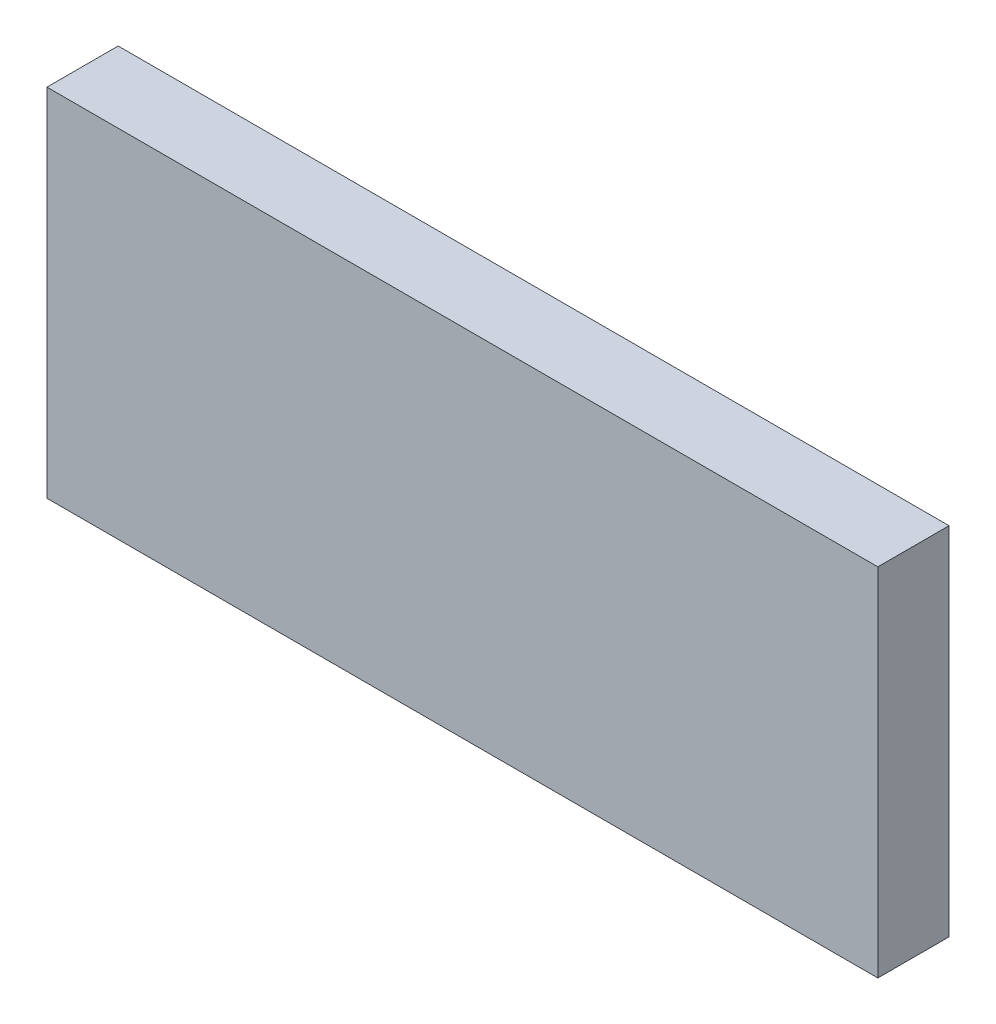
ISO-10303-21;
HEADER;
FILE_DESCRIPTION(('STEP AP214'),'2;1');
FILE_NAME('part.step','',(''),(''),'','','');
FILE_SCHEMA(('AUTOMOTIVE_DESIGN { 1 0 10303 214 1 1 1 1 }'));
ENDSEC;
DATA;
#1=APPLICATION_CONTEXT('core data for automotive mechanical design processes');
#2=APPLICATION_PROTOCOL_DEFINITION('international standard','automotive_design',2000,#1);
#3=PRODUCT_CONTEXT('',#1,'mechanical');
#4=PRODUCT('Part','Part','',(#3));
#5=PRODUCT_RELATED_PRODUCT_CATEGORY('part','',(#4));
#6=PRODUCT_DEFINITION_FORMATION('','',#4);
#7=PRODUCT_DEFINITION_CONTEXT('part definition',#1,'design');
#8=PRODUCT_DEFINITION('design','',#6,#7);
#9=PRODUCT_DEFINITION_SHAPE('','',#8);
#10=(LENGTH_UNIT() NAMED_UNIT(*) SI_UNIT(.MILLI.,.METRE.));
#11=(NAMED_UNIT(*) PLANE_ANGLE_UNIT() SI_UNIT($,.RADIAN.));
#12=(NAMED_UNIT(*) SI_UNIT($,.STERADIAN.) SOLID_ANGLE_UNIT());
#13=UNCERTAINTY_MEASURE_WITH_UNIT(LENGTH_MEASURE(1.E-05),#10,'distance_accuracy_value','');
#14=(GEOMETRIC_REPRESENTATION_CONTEXT(3) GLOBAL_UNCERTAINTY_ASSIGNED_CONTEXT((#13)) GLOBAL_UNIT_ASSIGNED_CONTEXT((#10,
#11,#12)) REPRESENTATION_CONTEXT('',''));
#15=CARTESIAN_POINT('',(0.,0.,0.));
#16=DIRECTION('',(0.,0.,1.));
#17=DIRECTION('',(1.,0.,0.));
#18=AXIS2_PLACEMENT_3D('',#15,#16,#17);
#19=CARTESIAN_POINT('',(17.5,-7.5,3.));
#20=DIRECTION('',(-1.,0.,0.));
#21=DIRECTION('',(0.,0.,1.));
#22=AXIS2_PLACEMENT_3D('',#19,#20,#21);
#23=PLANE('',#22);
#24=DIRECTION('',(0.,1.,0.));
#25=VECTOR('',#24,1.);
#26=CARTESIAN_POINT('',(17.5,-7.5,0.));
#27=LINE('',#26,#25);
#28=CARTESIAN_POINT('',(17.5,-7.5,0.));
#29=VERTEX_POINT('',#28);
#30=CARTESIAN_POINT('',(17.5,7.5,0.));
#31=VERTEX_POINT('',#30);
#32=EDGE_CURVE('E111',#29,#31,#27,.T.);
#33=ORIENTED_EDGE('',*,*,#32,.T.);
#34=DIRECTION('',(0.,0.,-1.));
#35=VECTOR('',#34,1.);
#36=CARTESIAN_POINT('',(17.5,7.5,3.));
#37=LINE('',#36,#35);
#38=CARTESIAN_POINT('',(17.5,7.5,3.));
#39=VERTEX_POINT('',#38);
#40=EDGE_CURVE('E11',#39,#31,#37,.T.);
#41=ORIENTED_EDGE('',*,*,#40,.F.);
#42=DIRECTION('',(0.,1.,0.));
#43=VECTOR('',#42,1.);
#44=CARTESIAN_POINT('',(17.5,-7.5,3.));
#45=LINE('',#44,#43);
#46=CARTESIAN_POINT('',(17.5,-7.5,3.));
#47=VERTEX_POINT('',#46);
#48=EDGE_CURVE('E95',#47,#39,#45,.T.);
#49=ORIENTED_EDGE('',*,*,#48,.F.);
#50=DIRECTION('',(0.,0.,-1.));
#51=VECTOR('',#50,1.);
#52=CARTESIAN_POINT('',(17.5,-7.5,3.));
#53=LINE('',#52,#51);
#54=EDGE_CURVE('E107',#47,#29,#53,.T.);
#55=ORIENTED_EDGE('',*,*,#54,.T.);
#56=EDGE_LOOP('',(#33,#41,#49,#55));
#57=FACE_BOUND('',#56,.T.);
#58=ADVANCED_FACE('F43',(#57),#23,.F.);
#59=CARTESIAN_POINT('',(-17.5,7.5,3.));
#60=DIRECTION('',(0.,-1.,0.));
#61=DIRECTION('',(0.,0.,-1.));
#62=AXIS2_PLACEMENT_3D('',#59,#60,#61);
#63=PLANE('',#62);
#64=DIRECTION('',(-1.,0.,0.));
#65=VECTOR('',#64,1.);
#66=CARTESIAN_POINT('',(-17.5,7.5,0.));
#67=LINE('',#66,#65);
#68=CARTESIAN_POINT('',(-17.5,7.5,0.));
#69=VERTEX_POINT('',#68);
#70=EDGE_CURVE('E100',#31,#69,#67,.T.);
#71=ORIENTED_EDGE('',*,*,#70,.T.);
#72=DIRECTION('',(0.,0.,-1.));
#73=VECTOR('',#72,1.);
#74=CARTESIAN_POINT('',(-17.5,7.5,3.));
#75=LINE('',#74,#73);
#76=CARTESIAN_POINT('',(-17.5,7.5,3.));
#77=VERTEX_POINT('',#76);
#78=EDGE_CURVE('E52',#77,#69,#75,.T.);
#79=ORIENTED_EDGE('',*,*,#78,.F.);
#80=DIRECTION('',(-1.,0.,0.));
#81=VECTOR('',#80,1.);
#82=CARTESIAN_POINT('',(-17.5,7.5,3.));
#83=LINE('',#82,#81);
#84=EDGE_CURVE('E90',#39,#77,#83,.T.);
#85=ORIENTED_EDGE('',*,*,#84,.F.);
#86=ORIENTED_EDGE('',*,*,#40,.T.);
#87=EDGE_LOOP('',(#71,#79,#85,#86));
#88=FACE_BOUND('',#87,.T.);
#89=ADVANCED_FACE('F99',(#88),#63,.F.);
#90=CARTESIAN_POINT('',(-17.5,-7.5,3.));
#91=DIRECTION('',(1.,0.,0.));
#92=DIRECTION('',(0.,0.,-1.));
#93=AXIS2_PLACEMENT_3D('',#90,#91,#92);
#94=PLANE('',#93);
#95=DIRECTION('',(0.,-1.,0.));
#96=VECTOR('',#95,1.);
#97=CARTESIAN_POINT('',(-17.5,-7.5,0.));
#98=LINE('',#97,#96);
#99=CARTESIAN_POINT('',(-17.5,-7.5,0.));
#100=VERTEX_POINT('',#99);
#101=EDGE_CURVE('E77',#69,#100,#98,.T.);
#102=ORIENTED_EDGE('',*,*,#101,.T.);
#103=DIRECTION('',(0.,0.,-1.));
#104=VECTOR('',#103,1.);
#105=CARTESIAN_POINT('',(-17.5,-7.5,3.));
#106=LINE('',#105,#104);
#107=CARTESIAN_POINT('',(-17.5,-7.5,3.));
#108=VERTEX_POINT('',#107);
#109=EDGE_CURVE('E102',#108,#100,#106,.T.);
#110=ORIENTED_EDGE('',*,*,#109,.F.);
#111=DIRECTION('',(0.,-1.,0.));
#112=VECTOR('',#111,1.);
#113=CARTESIAN_POINT('',(-17.5,-7.5,3.));
#114=LINE('',#113,#112);
#115=EDGE_CURVE('E93',#77,#108,#114,.T.);
#116=ORIENTED_EDGE('',*,*,#115,.F.);
#117=ORIENTED_EDGE('',*,*,#78,.T.);
#118=EDGE_LOOP('',(#102,#110,#116,#117));
#119=FACE_BOUND('',#118,.T.);
#120=ADVANCED_FACE('F103',(#119),#94,.F.);
#121=CARTESIAN_POINT('',(-17.5,-7.5,3.));
#122=DIRECTION('',(0.,1.,0.));
#123=DIRECTION('',(0.,0.,1.));
#124=AXIS2_PLACEMENT_3D('',#121,#122,#123);
#125=PLANE('',#124);
#126=DIRECTION('',(1.,0.,0.));
#127=VECTOR('',#126,1.);
#128=CARTESIAN_POINT('',(-17.5,-7.5,0.));
#129=LINE('',#128,#127);
#130=EDGE_CURVE('E83',#100,#29,#129,.T.);
#131=ORIENTED_EDGE('',*,*,#130,.T.);
#132=ORIENTED_EDGE('',*,*,#54,.F.);
#133=DIRECTION('',(1.,0.,0.));
#134=VECTOR('',#133,1.);
#135=CARTESIAN_POINT('',(-17.5,-7.5,3.));
#136=LINE('',#135,#134);
#137=EDGE_CURVE('E60',#108,#47,#136,.T.);
#138=ORIENTED_EDGE('',*,*,#137,.F.);
#139=ORIENTED_EDGE('',*,*,#109,.T.);
#140=EDGE_LOOP('',(#131,#132,#138,#139));
#141=FACE_BOUND('',#140,.T.);
#142=ADVANCED_FACE('F124',(#141),#125,.F.);
#143=CARTESIAN_POINT('',(0.,0.,3.));
#144=DIRECTION('',(0.,0.,-1.));
#145=DIRECTION('',(-1.,0.,0.));
#146=AXIS2_PLACEMENT_3D('',#143,#144,#145);
#147=PLANE('',#146);
#148=ORIENTED_EDGE('',*,*,#48,.T.);
#149=ORIENTED_EDGE('',*,*,#84,.T.);
#150=ORIENTED_EDGE('',*,*,#115,.T.);
#151=ORIENTED_EDGE('',*,*,#137,.T.);
#152=EDGE_LOOP('',(#148,#149,#150,#151));
#153=FACE_BOUND('',#152,.T.);
#154=ADVANCED_FACE('F91',(#153),#147,.F.);
#155=CARTESIAN_POINT('',(0.,0.,0.));
#156=DIRECTION('',(0.,0.,-1.));
#157=DIRECTION('',(-1.,0.,0.));
#158=AXIS2_PLACEMENT_3D('',#155,#156,#157);
#159=PLANE('',#158);
#160=ORIENTED_EDGE('',*,*,#32,.F.);
#161=ORIENTED_EDGE('',*,*,#130,.F.);
#162=ORIENTED_EDGE('',*,*,#101,.F.);
#163=ORIENTED_EDGE('',*,*,#70,.F.);
#164=EDGE_LOOP('',(#160,#161,#162,#163));
#165=FACE_BOUND('',#164,.T.);
#166=ADVANCED_FACE('F127',(#165),#159,.T.);
#167=CLOSED_SHELL('',(#58,#89,#120,#142,#154,#166));
#168=MANIFOLD_SOLID_BREP('B2',#167);
#169=ADVANCED_BREP_SHAPE_REPRESENTATION('',(#18,#168),#14);
#170=SHAPE_DEFINITION_REPRESENTATION(#9,#169);
ENDSEC;
END-ISO-10303-21;
